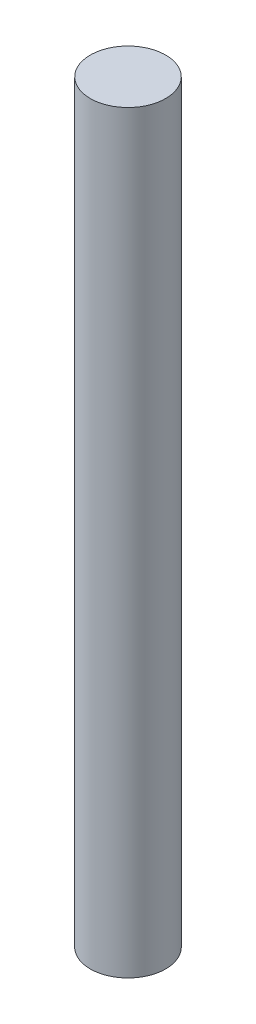
ISO-10303-21;
HEADER;
FILE_DESCRIPTION(('STEP AP214'),'2;1');
FILE_NAME('part.step','',(''),(''),'','','');
FILE_SCHEMA(('AUTOMOTIVE_DESIGN { 1 0 10303 214 1 1 1 1 }'));
ENDSEC;
DATA;
#1=APPLICATION_CONTEXT('core data for automotive mechanical design processes');
#2=APPLICATION_PROTOCOL_DEFINITION('international standard','automotive_design',2000,#1);
#3=PRODUCT_CONTEXT('',#1,'mechanical');
#4=PRODUCT('Part','Part','',(#3));
#5=PRODUCT_RELATED_PRODUCT_CATEGORY('part','',(#4));
#6=PRODUCT_DEFINITION_FORMATION('','',#4);
#7=PRODUCT_DEFINITION_CONTEXT('part definition',#1,'design');
#8=PRODUCT_DEFINITION('design','',#6,#7);
#9=PRODUCT_DEFINITION_SHAPE('','',#8);
#10=(LENGTH_UNIT() NAMED_UNIT(*) SI_UNIT(.MILLI.,.METRE.));
#11=(NAMED_UNIT(*) PLANE_ANGLE_UNIT() SI_UNIT($,.RADIAN.));
#12=(NAMED_UNIT(*) SI_UNIT($,.STERADIAN.) SOLID_ANGLE_UNIT());
#13=UNCERTAINTY_MEASURE_WITH_UNIT(LENGTH_MEASURE(1.E-05),#10,'distance_accuracy_value','');
#14=(GEOMETRIC_REPRESENTATION_CONTEXT(3) GLOBAL_UNCERTAINTY_ASSIGNED_CONTEXT((#13)) GLOBAL_UNIT_ASSIGNED_CONTEXT((#10,
#11,#12)) REPRESENTATION_CONTEXT('',''));
#15=CARTESIAN_POINT('',(0.,0.,0.));
#16=DIRECTION('',(0.,0.,1.));
#17=DIRECTION('',(1.,0.,0.));
#18=AXIS2_PLACEMENT_3D('',#15,#16,#17);
#19=CARTESIAN_POINT('',(0.,31.75,0.));
#20=DIRECTION('',(0.,-1.,0.));
#21=DIRECTION('',(0.,0.,-1.));
#22=AXIS2_PLACEMENT_3D('',#19,#20,#21);
#23=CYLINDRICAL_SURFACE('',#22,3.175);
#24=CARTESIAN_POINT('',(0.,31.75,0.));
#25=DIRECTION('',(0.,1.,0.));
#26=DIRECTION('',(0.,0.,1.));
#27=AXIS2_PLACEMENT_3D('',#24,#25,#26);
#28=CIRCLE('',#27,3.175);
#29=CARTESIAN_POINT('',(0.,31.75,3.175));
#30=VERTEX_POINT('',#29);
#31=EDGE_CURVE('E11',#30,#30,#28,.T.);
#32=ORIENTED_EDGE('',*,*,#31,.F.);
#33=EDGE_LOOP('',(#32));
#34=FACE_BOUND('',#33,.T.);
#35=CARTESIAN_POINT('',(0.,-31.75,0.));
#36=DIRECTION('',(0.,1.,0.));
#37=DIRECTION('',(0.,0.,1.));
#38=AXIS2_PLACEMENT_3D('',#35,#36,#37);
#39=CIRCLE('',#38,3.175);
#40=CARTESIAN_POINT('',(0.,-31.75,3.175));
#41=VERTEX_POINT('',#40);
#42=EDGE_CURVE('E45',#41,#41,#39,.T.);
#43=ORIENTED_EDGE('',*,*,#42,.T.);
#44=EDGE_LOOP('',(#43));
#45=FACE_BOUND('',#44,.T.);
#46=ADVANCED_FACE('F41',(#34,#45),#23,.T.);
#47=CARTESIAN_POINT('',(0.,31.75,0.));
#48=DIRECTION('',(0.,1.,0.));
#49=DIRECTION('',(0.,0.,1.));
#50=AXIS2_PLACEMENT_3D('',#47,#48,#49);
#51=PLANE('',#50);
#52=ORIENTED_EDGE('',*,*,#31,.T.);
#53=EDGE_LOOP('',(#52));
#54=FACE_BOUND('',#53,.T.);
#55=ADVANCED_FACE('F63',(#54),#51,.T.);
#56=CARTESIAN_POINT('',(0.,-31.75,0.));
#57=DIRECTION('',(0.,1.,0.));
#58=DIRECTION('',(0.,0.,1.));
#59=AXIS2_PLACEMENT_3D('',#56,#57,#58);
#60=PLANE('',#59);
#61=ORIENTED_EDGE('',*,*,#42,.F.);
#62=EDGE_LOOP('',(#61));
#63=FACE_BOUND('',#62,.T.);
#64=ADVANCED_FACE('F61',(#63),#60,.F.);
#65=CLOSED_SHELL('',(#46,#55,#64));
#66=MANIFOLD_SOLID_BREP('B2',#65);
#67=ADVANCED_BREP_SHAPE_REPRESENTATION('',(#18,#66),#14);
#68=SHAPE_DEFINITION_REPRESENTATION(#9,#67);
ENDSEC;
END-ISO-10303-21;
